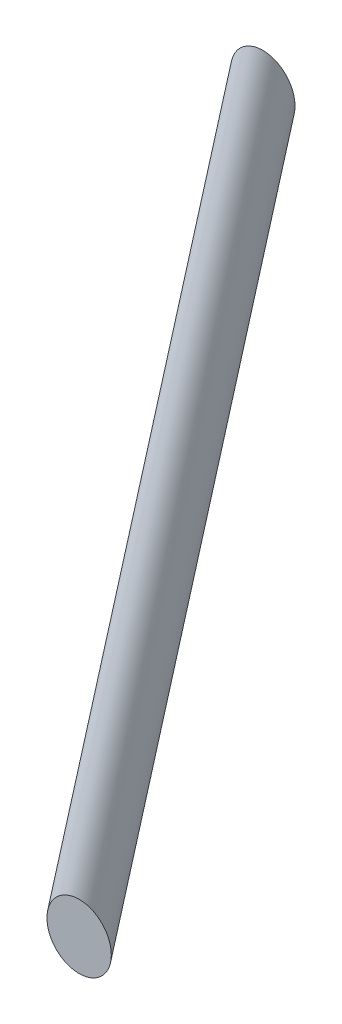
ISO-10303-21;
HEADER;
FILE_DESCRIPTION(('STEP AP214'),'2;1');
FILE_NAME('part.step','',(''),(''),'','','');
FILE_SCHEMA(('AUTOMOTIVE_DESIGN { 1 0 10303 214 1 1 1 1 }'));
ENDSEC;
DATA;
#1=APPLICATION_CONTEXT('core data for automotive mechanical design processes');
#2=APPLICATION_PROTOCOL_DEFINITION('international standard','automotive_design',2000,#1);
#3=PRODUCT_CONTEXT('',#1,'mechanical');
#4=PRODUCT('Part','Part','',(#3));
#5=PRODUCT_RELATED_PRODUCT_CATEGORY('part','',(#4));
#6=PRODUCT_DEFINITION_FORMATION('','',#4);
#7=PRODUCT_DEFINITION_CONTEXT('part definition',#1,'design');
#8=PRODUCT_DEFINITION('design','',#6,#7);
#9=PRODUCT_DEFINITION_SHAPE('','',#8);
#10=(LENGTH_UNIT() NAMED_UNIT(*) SI_UNIT(.MILLI.,.METRE.));
#11=(NAMED_UNIT(*) PLANE_ANGLE_UNIT() SI_UNIT($,.RADIAN.));
#12=(NAMED_UNIT(*) SI_UNIT($,.STERADIAN.) SOLID_ANGLE_UNIT());
#13=UNCERTAINTY_MEASURE_WITH_UNIT(LENGTH_MEASURE(1.E-05),#10,'distance_accuracy_value','');
#14=(GEOMETRIC_REPRESENTATION_CONTEXT(3) GLOBAL_UNCERTAINTY_ASSIGNED_CONTEXT((#13)) GLOBAL_UNIT_ASSIGNED_CONTEXT((#10,
#11,#12)) REPRESENTATION_CONTEXT('',''));
#15=CARTESIAN_POINT('',(0.,0.,0.));
#16=DIRECTION('',(0.,0.,1.));
#17=DIRECTION('',(1.,0.,0.));
#18=AXIS2_PLACEMENT_3D('',#15,#16,#17);
#19=CARTESIAN_POINT('',(7.7715611723761E-13,-255.,230.50237475119));
#20=DIRECTION('',(0.,0.,1.));
#21=DIRECTION('',(1.,0.,0.));
#22=AXIS2_PLACEMENT_3D('',#19,#20,#21);
#23=CIRCLE('',#22,4.34905468930244);
#24=DIRECTION('',(-0.621459234060241,-0.358799656075063,-0.696456191875466));
#25=VECTOR('',#24,1.);
#26=SURFACE_OF_LINEAR_EXTRUSION('',#23,#25);
#27=CARTESIAN_POINT('',(4.34905468930322,-255.,230.50237475119));
#28=VERTEX_POINT('',#27);
#29=EDGE_CURVE('E10',#28,#28,#23,.T.);
#30=ORIENTED_EDGE('',*,*,#29,.F.);
#31=EDGE_LOOP('',(#30));
#32=FACE_BOUND('',#31,.T.);
#33=CARTESIAN_POINT('',(-205.681033398803,-373.750000000001,0.));
#34=DIRECTION('',(0.,0.,1.));
#35=DIRECTION('',(1.,0.,0.));
#36=AXIS2_PLACEMENT_3D('',#33,#34,#35);
#37=CIRCLE('',#36,4.34905468930244);
#38=CARTESIAN_POINT('',(-201.331978709501,-373.750000000001,0.));
#39=VERTEX_POINT('',#38);
#40=EDGE_CURVE('E35',#39,#39,#37,.T.);
#41=ORIENTED_EDGE('',*,*,#40,.T.);
#42=EDGE_LOOP('',(#41));
#43=FACE_BOUND('',#42,.T.);
#44=ADVANCED_FACE('F31',(#32,#43),#26,.F.);
#45=CARTESIAN_POINT('',(7.7715611723761E-13,-255.,230.50237475119));
#46=DIRECTION('',(0.,0.,1.));
#47=DIRECTION('',(1.,0.,0.));
#48=AXIS2_PLACEMENT_3D('',#45,#46,#47);
#49=PLANE('',#48);
#50=ORIENTED_EDGE('',*,*,#29,.T.);
#51=EDGE_LOOP('',(#50));
#52=FACE_BOUND('',#51,.T.);
#53=ADVANCED_FACE('F47',(#52),#49,.T.);
#54=CARTESIAN_POINT('',(-205.681033398803,-373.750000000001,0.));
#55=DIRECTION('',(0.,0.,1.));
#56=DIRECTION('',(1.,0.,0.));
#57=AXIS2_PLACEMENT_3D('',#54,#55,#56);
#58=PLANE('',#57);
#59=ORIENTED_EDGE('',*,*,#40,.F.);
#60=EDGE_LOOP('',(#59));
#61=FACE_BOUND('',#60,.T.);
#62=ADVANCED_FACE('F45',(#61),#58,.F.);
#63=CLOSED_SHELL('',(#44,#53,#62));
#64=MANIFOLD_SOLID_BREP('B2',#63);
#65=ADVANCED_BREP_SHAPE_REPRESENTATION('',(#18,#64),#14);
#66=SHAPE_DEFINITION_REPRESENTATION(#9,#65);
ENDSEC;
END-ISO-10303-21;
